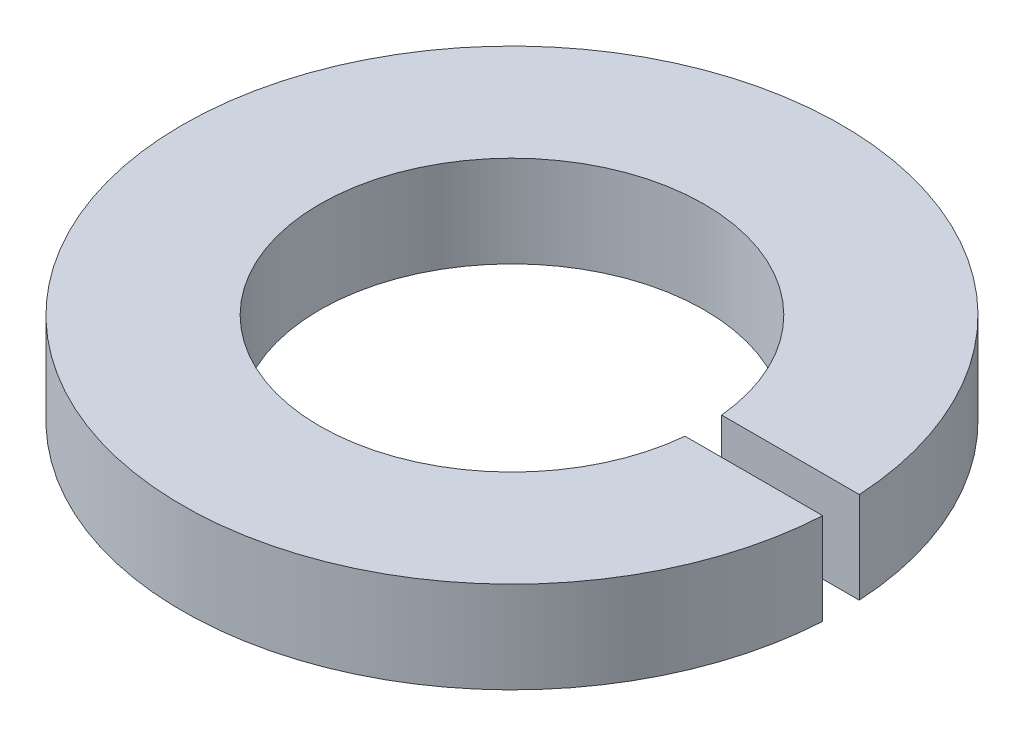
ISO-10303-21;
HEADER;
FILE_DESCRIPTION(('STEP AP214'),'2;1');
FILE_NAME('part.step','',(''),(''),'','','');
FILE_SCHEMA(('AUTOMOTIVE_DESIGN { 1 0 10303 214 1 1 1 1 }'));
ENDSEC;
DATA;
#1=APPLICATION_CONTEXT('core data for automotive mechanical design processes');
#2=APPLICATION_PROTOCOL_DEFINITION('international standard','automotive_design',2000,#1);
#3=PRODUCT_CONTEXT('',#1,'mechanical');
#4=PRODUCT('Part','Part','',(#3));
#5=PRODUCT_RELATED_PRODUCT_CATEGORY('part','',(#4));
#6=PRODUCT_DEFINITION_FORMATION('','',#4);
#7=PRODUCT_DEFINITION_CONTEXT('part definition',#1,'design');
#8=PRODUCT_DEFINITION('design','',#6,#7);
#9=PRODUCT_DEFINITION_SHAPE('','',#8);
#10=(LENGTH_UNIT() NAMED_UNIT(*) SI_UNIT(.MILLI.,.METRE.));
#11=(NAMED_UNIT(*) PLANE_ANGLE_UNIT() SI_UNIT($,.RADIAN.));
#12=(NAMED_UNIT(*) SI_UNIT($,.STERADIAN.) SOLID_ANGLE_UNIT());
#13=UNCERTAINTY_MEASURE_WITH_UNIT(LENGTH_MEASURE(1.E-05),#10,'distance_accuracy_value','');
#14=(GEOMETRIC_REPRESENTATION_CONTEXT(3) GLOBAL_UNCERTAINTY_ASSIGNED_CONTEXT((#13)) GLOBAL_UNIT_ASSIGNED_CONTEXT((#10,
#11,#12)) REPRESENTATION_CONTEXT('',''));
#15=CARTESIAN_POINT('',(0.,0.,0.));
#16=DIRECTION('',(0.,0.,1.));
#17=DIRECTION('',(1.,0.,0.));
#18=AXIS2_PLACEMENT_3D('',#15,#16,#17);
#19=CARTESIAN_POINT('',(0.,1.,0.));
#20=DIRECTION('',(0.,1.,0.));
#21=DIRECTION('',(0.,0.,1.));
#22=AXIS2_PLACEMENT_3D('',#19,#20,#21);
#23=PLANE('',#22);
#24=DIRECTION('',(1.,0.,0.));
#25=VECTOR('',#24,1.);
#26=CARTESIAN_POINT('',(2.,1.,0.2));
#27=LINE('',#26,#25);
#28=CARTESIAN_POINT('',(3.59444015112229,1.,0.2));
#29=VERTEX_POINT('',#28);
#30=CARTESIAN_POINT('',(2.09045449603669,1.,0.2));
#31=VERTEX_POINT('',#30);
#32=EDGE_CURVE('E60',#29,#31,#27,.F.);
#33=ORIENTED_EDGE('',*,*,#32,.T.);
#34=CARTESIAN_POINT('',(0.,1.,0.));
#35=DIRECTION('',(0.,-1.,0.));
#36=DIRECTION('',(0.,0.,-1.));
#37=AXIS2_PLACEMENT_3D('',#34,#35,#36);
#38=CIRCLE('',#37,2.1);
#39=CARTESIAN_POINT('',(2.09045449603669,1.,-0.2));
#40=VERTEX_POINT('',#39);
#41=EDGE_CURVE('E20',#31,#40,#38,.T.);
#42=ORIENTED_EDGE('',*,*,#41,.T.);
#43=DIRECTION('',(-1.,0.,0.));
#44=VECTOR('',#43,1.);
#45=CARTESIAN_POINT('',(2.,1.,-0.2));
#46=LINE('',#45,#44);
#47=CARTESIAN_POINT('',(3.59444015112229,1.,-0.2));
#48=VERTEX_POINT('',#47);
#49=EDGE_CURVE('E63',#40,#48,#46,.F.);
#50=ORIENTED_EDGE('',*,*,#49,.T.);
#51=CARTESIAN_POINT('',(0.,1.,0.));
#52=DIRECTION('',(0.,-1.,0.));
#53=DIRECTION('',(0.,0.,-1.));
#54=AXIS2_PLACEMENT_3D('',#51,#52,#53);
#55=CIRCLE('',#54,3.6);
#56=EDGE_CURVE('E58',#29,#48,#55,.T.);
#57=ORIENTED_EDGE('',*,*,#56,.F.);
#58=EDGE_LOOP('',(#33,#42,#50,#57));
#59=FACE_BOUND('',#58,.T.);
#60=ADVANCED_FACE('F17',(#59),#23,.T.);
#61=CARTESIAN_POINT('',(2.,0.,0.2));
#62=DIRECTION('',(0.,0.,1.));
#63=DIRECTION('',(1.,0.,0.));
#64=AXIS2_PLACEMENT_3D('',#61,#62,#63);
#65=PLANE('',#64);
#66=DIRECTION('',(0.,-1.,0.));
#67=VECTOR('',#66,1.);
#68=CARTESIAN_POINT('',(2.09045449603669,1.,0.2));
#69=LINE('',#68,#67);
#70=CARTESIAN_POINT('',(2.09045449603669,0.,0.2));
#71=VERTEX_POINT('',#70);
#72=EDGE_CURVE('E73',#71,#31,#69,.F.);
#73=ORIENTED_EDGE('',*,*,#72,.T.);
#74=ORIENTED_EDGE('',*,*,#32,.F.);
#75=DIRECTION('',(0.,1.,0.));
#76=VECTOR('',#75,1.);
#77=CARTESIAN_POINT('',(3.59444015112229,0.,0.2));
#78=LINE('',#77,#76);
#79=CARTESIAN_POINT('',(3.59444015112229,0.,0.2));
#80=VERTEX_POINT('',#79);
#81=EDGE_CURVE('E72',#80,#29,#78,.T.);
#82=ORIENTED_EDGE('',*,*,#81,.F.);
#83=DIRECTION('',(1.,0.,0.));
#84=VECTOR('',#83,1.);
#85=CARTESIAN_POINT('',(0.,0.,0.2));
#86=LINE('',#85,#84);
#87=EDGE_CURVE('E83',#80,#71,#86,.F.);
#88=ORIENTED_EDGE('',*,*,#87,.T.);
#89=EDGE_LOOP('',(#73,#74,#82,#88));
#90=FACE_BOUND('',#89,.T.);
#91=ADVANCED_FACE('F70',(#90),#65,.F.);
#92=CARTESIAN_POINT('',(0.,1.,0.));
#93=DIRECTION('',(0.,-1.,0.));
#94=DIRECTION('',(0.,0.,-1.));
#95=AXIS2_PLACEMENT_3D('',#92,#93,#94);
#96=CYLINDRICAL_SURFACE('',#95,2.1);
#97=ORIENTED_EDGE('',*,*,#41,.F.);
#98=ORIENTED_EDGE('',*,*,#72,.F.);
#99=CARTESIAN_POINT('',(0.,0.,0.));
#100=DIRECTION('',(0.,-1.,0.));
#101=DIRECTION('',(0.,0.,-1.));
#102=AXIS2_PLACEMENT_3D('',#99,#100,#101);
#103=CIRCLE('',#102,2.1);
#104=CARTESIAN_POINT('',(2.09045449603669,0.,-0.2));
#105=VERTEX_POINT('',#104);
#106=EDGE_CURVE('E26',#71,#105,#103,.T.);
#107=ORIENTED_EDGE('',*,*,#106,.T.);
#108=DIRECTION('',(0.,1.,0.));
#109=VECTOR('',#108,1.);
#110=CARTESIAN_POINT('',(2.09045449603669,0.,-0.2));
#111=LINE('',#110,#109);
#112=EDGE_CURVE('E80',#105,#40,#111,.T.);
#113=ORIENTED_EDGE('',*,*,#112,.T.);
#114=EDGE_LOOP('',(#97,#98,#107,#113));
#115=FACE_BOUND('',#114,.T.);
#116=ADVANCED_FACE('F91',(#115),#96,.F.);
#117=CARTESIAN_POINT('',(2.,0.,-0.2));
#118=DIRECTION('',(0.,0.,-1.));
#119=DIRECTION('',(-1.,0.,0.));
#120=AXIS2_PLACEMENT_3D('',#117,#118,#119);
#121=PLANE('',#120);
#122=ORIENTED_EDGE('',*,*,#112,.F.);
#123=DIRECTION('',(1.,0.,0.));
#124=VECTOR('',#123,1.);
#125=CARTESIAN_POINT('',(0.,0.,-0.2));
#126=LINE('',#125,#124);
#127=CARTESIAN_POINT('',(3.59444015112229,0.,-0.2));
#128=VERTEX_POINT('',#127);
#129=EDGE_CURVE('E11',#105,#128,#126,.T.);
#130=ORIENTED_EDGE('',*,*,#129,.T.);
#131=DIRECTION('',(0.,-1.,0.));
#132=VECTOR('',#131,1.);
#133=CARTESIAN_POINT('',(3.59444015112229,1.,-0.2));
#134=LINE('',#133,#132);
#135=EDGE_CURVE('E67',#48,#128,#134,.T.);
#136=ORIENTED_EDGE('',*,*,#135,.F.);
#137=ORIENTED_EDGE('',*,*,#49,.F.);
#138=EDGE_LOOP('',(#122,#130,#136,#137));
#139=FACE_BOUND('',#138,.T.);
#140=ADVANCED_FACE('F88',(#139),#121,.F.);
#141=CARTESIAN_POINT('',(0.,1.,0.));
#142=DIRECTION('',(0.,-1.,0.));
#143=DIRECTION('',(0.,0.,-1.));
#144=AXIS2_PLACEMENT_3D('',#141,#142,#143);
#145=CYLINDRICAL_SURFACE('',#144,3.6);
#146=ORIENTED_EDGE('',*,*,#135,.T.);
#147=CARTESIAN_POINT('',(0.,0.,0.));
#148=DIRECTION('',(0.,-1.,0.));
#149=DIRECTION('',(0.,0.,-1.));
#150=AXIS2_PLACEMENT_3D('',#147,#148,#149);
#151=CIRCLE('',#150,3.6);
#152=EDGE_CURVE('E35',#128,#80,#151,.F.);
#153=ORIENTED_EDGE('',*,*,#152,.T.);
#154=ORIENTED_EDGE('',*,*,#81,.T.);
#155=ORIENTED_EDGE('',*,*,#56,.T.);
#156=EDGE_LOOP('',(#146,#153,#154,#155));
#157=FACE_BOUND('',#156,.T.);
#158=ADVANCED_FACE('F75',(#157),#145,.T.);
#159=CARTESIAN_POINT('',(0.,0.,0.));
#160=DIRECTION('',(0.,1.,0.));
#161=DIRECTION('',(0.,0.,1.));
#162=AXIS2_PLACEMENT_3D('',#159,#160,#161);
#163=PLANE('',#162);
#164=ORIENTED_EDGE('',*,*,#129,.F.);
#165=ORIENTED_EDGE('',*,*,#106,.F.);
#166=ORIENTED_EDGE('',*,*,#87,.F.);
#167=ORIENTED_EDGE('',*,*,#152,.F.);
#168=EDGE_LOOP('',(#164,#165,#166,#167));
#169=FACE_BOUND('',#168,.T.);
#170=ADVANCED_FACE('F90',(#169),#163,.F.);
#171=CLOSED_SHELL('',(#60,#91,#116,#140,#158,#170));
#172=MANIFOLD_SOLID_BREP('B1',#171);
#173=ADVANCED_BREP_SHAPE_REPRESENTATION('',(#18,#172),#14);
#174=SHAPE_DEFINITION_REPRESENTATION(#9,#173);
ENDSEC;
END-ISO-10303-21;
